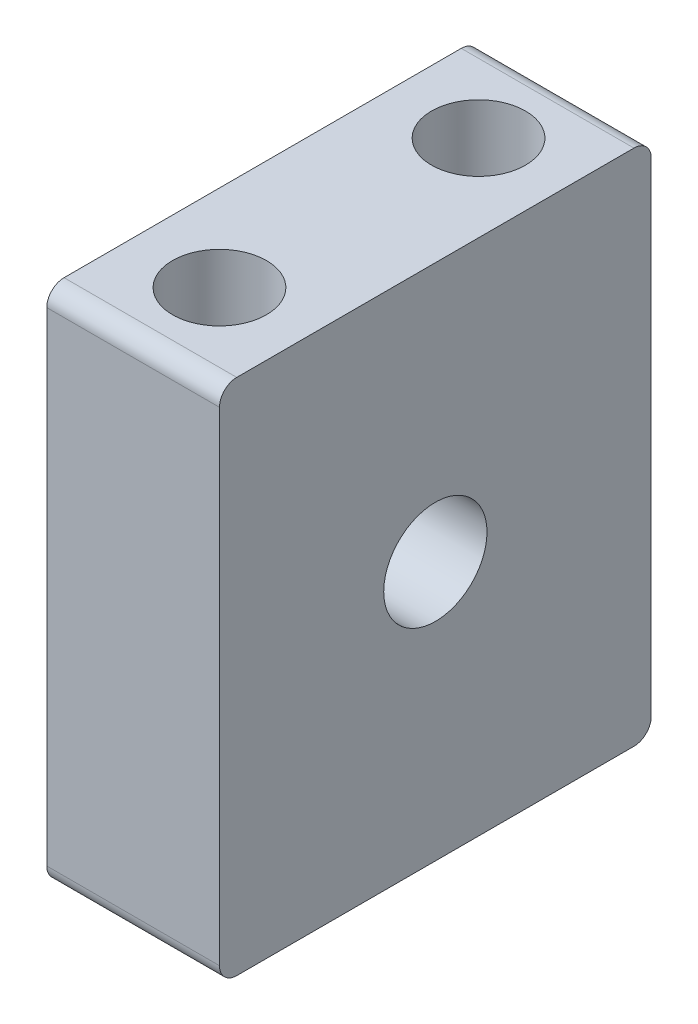
ISO-10303-21;
HEADER;
FILE_DESCRIPTION(('STEP AP214'),'2;1');
FILE_NAME('part.step','',(''),(''),'','','');
FILE_SCHEMA(('AUTOMOTIVE_DESIGN { 1 0 10303 214 1 1 1 1 }'));
ENDSEC;
DATA;
#1=APPLICATION_CONTEXT('core data for automotive mechanical design processes');
#2=APPLICATION_PROTOCOL_DEFINITION('international standard','automotive_design',2000,#1);
#3=PRODUCT_CONTEXT('',#1,'mechanical');
#4=PRODUCT('Part','Part','',(#3));
#5=PRODUCT_RELATED_PRODUCT_CATEGORY('part','',(#4));
#6=PRODUCT_DEFINITION_FORMATION('','',#4);
#7=PRODUCT_DEFINITION_CONTEXT('part definition',#1,'design');
#8=PRODUCT_DEFINITION('design','',#6,#7);
#9=PRODUCT_DEFINITION_SHAPE('','',#8);
#10=(LENGTH_UNIT() NAMED_UNIT(*) SI_UNIT(.MILLI.,.METRE.));
#11=(NAMED_UNIT(*) PLANE_ANGLE_UNIT() SI_UNIT($,.RADIAN.));
#12=(NAMED_UNIT(*) SI_UNIT($,.STERADIAN.) SOLID_ANGLE_UNIT());
#13=UNCERTAINTY_MEASURE_WITH_UNIT(LENGTH_MEASURE(1.E-05),#10,'distance_accuracy_value','');
#14=(GEOMETRIC_REPRESENTATION_CONTEXT(3) GLOBAL_UNCERTAINTY_ASSIGNED_CONTEXT((#13)) GLOBAL_UNIT_ASSIGNED_CONTEXT((#10,
#11,#12)) REPRESENTATION_CONTEXT('',''));
#15=CARTESIAN_POINT('',(0.,0.,0.));
#16=DIRECTION('',(0.,0.,1.));
#17=DIRECTION('',(1.,0.,0.));
#18=AXIS2_PLACEMENT_3D('',#15,#16,#17);
#19=CARTESIAN_POINT('',(0.,6.35000000000001,0.));
#20=DIRECTION('',(0.,-1.,0.));
#21=DIRECTION('',(0.,0.,-1.));
#22=AXIS2_PLACEMENT_3D('',#19,#20,#21);
#23=PLANE('',#22);
#24=CARTESIAN_POINT('',(-44.45,6.35000000000001,20.87372));
#25=DIRECTION('',(0.,1.,0.));
#26=DIRECTION('',(0.,0.,1.));
#27=AXIS2_PLACEMENT_3D('',#24,#25,#26);
#28=CIRCLE('',#27,1.7272);
#29=CARTESIAN_POINT('',(-44.45,6.35000000000001,22.60092));
#30=VERTEX_POINT('',#29);
#31=EDGE_CURVE('E190',#30,#30,#28,.T.);
#32=ORIENTED_EDGE('',*,*,#31,.T.);
#33=EDGE_LOOP('',(#32));
#34=FACE_BOUND('',#33,.T.);
#35=DIRECTION('',(0.,0.,1.));
#36=VECTOR('',#35,1.);
#37=CARTESIAN_POINT('',(-47.625,6.35000000000001,33.57372));
#38=LINE('',#37,#36);
#39=CARTESIAN_POINT('',(-47.625,6.35000000000001,18.33372));
#40=VERTEX_POINT('',#39);
#41=CARTESIAN_POINT('',(-47.625,6.35000000000001,32.93872));
#42=VERTEX_POINT('',#41);
#43=EDGE_CURVE('E119',#40,#42,#38,.T.);
#44=ORIENTED_EDGE('',*,*,#43,.F.);
#45=DIRECTION('',(-1.,0.,0.));
#46=VECTOR('',#45,1.);
#47=CARTESIAN_POINT('',(-41.275,6.35000000000001,18.33372));
#48=LINE('',#47,#46);
#49=CARTESIAN_POINT('',(-41.275,6.35000000000001,18.33372));
#50=VERTEX_POINT('',#49);
#51=EDGE_CURVE('E145',#40,#50,#48,.F.);
#52=ORIENTED_EDGE('',*,*,#51,.T.);
#53=DIRECTION('',(0.,0.,-1.));
#54=VECTOR('',#53,1.);
#55=CARTESIAN_POINT('',(-41.275,6.35000000000001,33.57372));
#56=LINE('',#55,#54);
#57=CARTESIAN_POINT('',(-41.275,6.35000000000001,32.93872));
#58=VERTEX_POINT('',#57);
#59=EDGE_CURVE('E170',#58,#50,#56,.T.);
#60=ORIENTED_EDGE('',*,*,#59,.F.);
#61=DIRECTION('',(1.,0.,0.));
#62=VECTOR('',#61,1.);
#63=CARTESIAN_POINT('',(-47.625,6.35000000000001,32.93872));
#64=LINE('',#63,#62);
#65=EDGE_CURVE('E50',#58,#42,#64,.F.);
#66=ORIENTED_EDGE('',*,*,#65,.T.);
#67=EDGE_LOOP('',(#44,#52,#60,#66));
#68=FACE_BOUND('',#67,.T.);
#69=CARTESIAN_POINT('',(-44.45,6.35000000000001,30.39872));
#70=DIRECTION('',(0.,1.,0.));
#71=DIRECTION('',(0.,0.,1.));
#72=AXIS2_PLACEMENT_3D('',#69,#70,#71);
#73=CIRCLE('',#72,1.7272);
#74=CARTESIAN_POINT('',(-44.45,6.35000000000001,32.12592));
#75=VERTEX_POINT('',#74);
#76=EDGE_CURVE('E167',#75,#75,#73,.T.);
#77=ORIENTED_EDGE('',*,*,#76,.T.);
#78=EDGE_LOOP('',(#77));
#79=FACE_BOUND('',#78,.T.);
#80=ADVANCED_FACE('F35',(#34,#68,#79),#23,.T.);
#81=CARTESIAN_POINT('',(-47.625,42.4978982626521,33.57372));
#82=DIRECTION('',(1.,0.,0.));
#83=DIRECTION('',(0.,0.,-1.));
#84=AXIS2_PLACEMENT_3D('',#81,#82,#83);
#85=PLANE('',#84);
#86=CARTESIAN_POINT('',(-47.625,15.875,25.63622));
#87=DIRECTION('',(-1.,0.,0.));
#88=DIRECTION('',(0.,0.,1.));
#89=AXIS2_PLACEMENT_3D('',#86,#87,#88);
#90=CIRCLE('',#89,1.89865);
#91=CARTESIAN_POINT('',(-47.625,15.875,27.53487));
#92=VERTEX_POINT('',#91);
#93=EDGE_CURVE('E196',#92,#92,#90,.T.);
#94=ORIENTED_EDGE('',*,*,#93,.F.);
#95=EDGE_LOOP('',(#94));
#96=FACE_BOUND('',#95,.T.);
#97=DIRECTION('',(0.,0.,-1.));
#98=VECTOR('',#97,1.);
#99=CARTESIAN_POINT('',(-47.625,25.4,33.57372));
#100=LINE('',#99,#98);
#101=CARTESIAN_POINT('',(-47.625,25.4,32.93872));
#102=VERTEX_POINT('',#101);
#103=CARTESIAN_POINT('',(-47.625,25.4,18.33372));
#104=VERTEX_POINT('',#103);
#105=EDGE_CURVE('E105',#102,#104,#100,.T.);
#106=ORIENTED_EDGE('',*,*,#105,.T.);
#107=CARTESIAN_POINT('',(-47.625,24.765,18.33372));
#108=DIRECTION('',(1.,0.,0.));
#109=DIRECTION('',(0.,0.,-1.));
#110=AXIS2_PLACEMENT_3D('',#107,#108,#109);
#111=CIRCLE('',#110,0.635);
#112=CARTESIAN_POINT('',(-47.625,24.765,17.69872));
#113=VERTEX_POINT('',#112);
#114=EDGE_CURVE('E100',#104,#113,#111,.F.);
#115=ORIENTED_EDGE('',*,*,#114,.T.);
#116=DIRECTION('',(0.,-1.,0.));
#117=VECTOR('',#116,1.);
#118=CARTESIAN_POINT('',(-47.625,42.4978982626521,17.69872));
#119=LINE('',#118,#117);
#120=CARTESIAN_POINT('',(-47.625,6.98500000000001,17.69872));
#121=VERTEX_POINT('',#120);
#122=EDGE_CURVE('E103',#113,#121,#119,.T.);
#123=ORIENTED_EDGE('',*,*,#122,.T.);
#124=CARTESIAN_POINT('',(-47.625,6.98500000000001,18.33372));
#125=DIRECTION('',(1.,0.,0.));
#126=DIRECTION('',(0.,0.,-1.));
#127=AXIS2_PLACEMENT_3D('',#124,#125,#126);
#128=CIRCLE('',#127,0.635);
#129=EDGE_CURVE('E57',#121,#40,#128,.F.);
#130=ORIENTED_EDGE('',*,*,#129,.T.);
#131=ORIENTED_EDGE('',*,*,#43,.T.);
#132=CARTESIAN_POINT('',(-47.625,6.98500000000001,32.93872));
#133=DIRECTION('',(1.,0.,0.));
#134=DIRECTION('',(0.,0.,-1.));
#135=AXIS2_PLACEMENT_3D('',#132,#133,#134);
#136=CIRCLE('',#135,0.635);
#137=CARTESIAN_POINT('',(-47.625,6.98500000000001,33.57372));
#138=VERTEX_POINT('',#137);
#139=EDGE_CURVE('E141',#42,#138,#136,.F.);
#140=ORIENTED_EDGE('',*,*,#139,.T.);
#141=DIRECTION('',(0.,-1.,0.));
#142=VECTOR('',#141,1.);
#143=CARTESIAN_POINT('',(-47.625,42.4978982626521,33.57372));
#144=LINE('',#143,#142);
#145=CARTESIAN_POINT('',(-47.625,24.765,33.57372));
#146=VERTEX_POINT('',#145);
#147=EDGE_CURVE('E153',#146,#138,#144,.T.);
#148=ORIENTED_EDGE('',*,*,#147,.F.);
#149=CARTESIAN_POINT('',(-47.625,24.765,32.93872));
#150=DIRECTION('',(1.,0.,0.));
#151=DIRECTION('',(0.,0.,-1.));
#152=AXIS2_PLACEMENT_3D('',#149,#150,#151);
#153=CIRCLE('',#152,0.635);
#154=EDGE_CURVE('E139',#146,#102,#153,.F.);
#155=ORIENTED_EDGE('',*,*,#154,.T.);
#156=EDGE_LOOP('',(#106,#115,#123,#130,#131,#140,#148,#155));
#157=FACE_BOUND('',#156,.T.);
#158=ADVANCED_FACE('F102',(#96,#157),#85,.F.);
#159=CARTESIAN_POINT('',(-47.625,42.4978982626521,33.57372));
#160=DIRECTION('',(0.,0.,-1.));
#161=DIRECTION('',(-1.,0.,0.));
#162=AXIS2_PLACEMENT_3D('',#159,#160,#161);
#163=PLANE('',#162);
#164=ORIENTED_EDGE('',*,*,#147,.T.);
#165=DIRECTION('',(1.,0.,0.));
#166=VECTOR('',#165,1.);
#167=CARTESIAN_POINT('',(-41.275,6.98500000000001,33.57372));
#168=LINE('',#167,#166);
#169=CARTESIAN_POINT('',(-41.275,6.98500000000001,33.57372));
#170=VERTEX_POINT('',#169);
#171=EDGE_CURVE('E11',#138,#170,#168,.T.);
#172=ORIENTED_EDGE('',*,*,#171,.T.);
#173=DIRECTION('',(0.,-1.,0.));
#174=VECTOR('',#173,1.);
#175=CARTESIAN_POINT('',(-41.275,42.4978982626521,33.57372));
#176=LINE('',#175,#174);
#177=CARTESIAN_POINT('',(-41.275,24.765,33.57372));
#178=VERTEX_POINT('',#177);
#179=EDGE_CURVE('E156',#178,#170,#176,.T.);
#180=ORIENTED_EDGE('',*,*,#179,.F.);
#181=DIRECTION('',(-1.,0.,0.));
#182=VECTOR('',#181,1.);
#183=CARTESIAN_POINT('',(-47.625,24.765,33.57372));
#184=LINE('',#183,#182);
#185=EDGE_CURVE('E43',#178,#146,#184,.T.);
#186=ORIENTED_EDGE('',*,*,#185,.T.);
#187=EDGE_LOOP('',(#164,#172,#180,#186));
#188=FACE_BOUND('',#187,.T.);
#189=ADVANCED_FACE('F152',(#188),#163,.F.);
#190=CARTESIAN_POINT('',(-41.275,42.4978982626521,33.57372));
#191=DIRECTION('',(-1.,0.,0.));
#192=DIRECTION('',(0.,0.,1.));
#193=AXIS2_PLACEMENT_3D('',#190,#191,#192);
#194=PLANE('',#193);
#195=CARTESIAN_POINT('',(-41.275,15.875,25.63622));
#196=DIRECTION('',(-1.,0.,0.));
#197=DIRECTION('',(0.,0.,1.));
#198=AXIS2_PLACEMENT_3D('',#195,#196,#197);
#199=CIRCLE('',#198,1.89865);
#200=CARTESIAN_POINT('',(-41.275,15.875,27.53487));
#201=VERTEX_POINT('',#200);
#202=EDGE_CURVE('E192',#201,#201,#199,.T.);
#203=ORIENTED_EDGE('',*,*,#202,.T.);
#204=EDGE_LOOP('',(#203));
#205=FACE_BOUND('',#204,.T.);
#206=DIRECTION('',(0.,-1.,0.));
#207=VECTOR('',#206,1.);
#208=CARTESIAN_POINT('',(-41.275,42.4978982626521,17.69872));
#209=LINE('',#208,#207);
#210=CARTESIAN_POINT('',(-41.275,24.765,17.69872));
#211=VERTEX_POINT('',#210);
#212=CARTESIAN_POINT('',(-41.275,6.98500000000001,17.69872));
#213=VERTEX_POINT('',#212);
#214=EDGE_CURVE('E171',#211,#213,#209,.T.);
#215=ORIENTED_EDGE('',*,*,#214,.F.);
#216=CARTESIAN_POINT('',(-41.275,24.765,18.33372));
#217=DIRECTION('',(-1.,0.,0.));
#218=DIRECTION('',(0.,0.,1.));
#219=AXIS2_PLACEMENT_3D('',#216,#217,#218);
#220=CIRCLE('',#219,0.635);
#221=CARTESIAN_POINT('',(-41.275,25.4,18.33372));
#222=VERTEX_POINT('',#221);
#223=EDGE_CURVE('E122',#211,#222,#220,.F.);
#224=ORIENTED_EDGE('',*,*,#223,.T.);
#225=DIRECTION('',(0.,0.,1.));
#226=VECTOR('',#225,1.);
#227=CARTESIAN_POINT('',(-41.275,25.4,33.57372));
#228=LINE('',#227,#226);
#229=CARTESIAN_POINT('',(-41.275,25.4,32.93872));
#230=VERTEX_POINT('',#229);
#231=EDGE_CURVE('E160',#222,#230,#228,.T.);
#232=ORIENTED_EDGE('',*,*,#231,.T.);
#233=CARTESIAN_POINT('',(-41.275,24.765,32.93872));
#234=DIRECTION('',(-1.,0.,0.));
#235=DIRECTION('',(0.,0.,1.));
#236=AXIS2_PLACEMENT_3D('',#233,#234,#235);
#237=CIRCLE('',#236,0.635);
#238=EDGE_CURVE('E123',#230,#178,#237,.F.);
#239=ORIENTED_EDGE('',*,*,#238,.T.);
#240=ORIENTED_EDGE('',*,*,#179,.T.);
#241=CARTESIAN_POINT('',(-41.275,6.98500000000001,32.93872));
#242=DIRECTION('',(-1.,0.,0.));
#243=DIRECTION('',(0.,0.,1.));
#244=AXIS2_PLACEMENT_3D('',#241,#242,#243);
#245=CIRCLE('',#244,0.635);
#246=EDGE_CURVE('E125',#170,#58,#245,.F.);
#247=ORIENTED_EDGE('',*,*,#246,.T.);
#248=ORIENTED_EDGE('',*,*,#59,.T.);
#249=CARTESIAN_POINT('',(-41.275,6.98500000000001,18.33372));
#250=DIRECTION('',(-1.,0.,0.));
#251=DIRECTION('',(0.,0.,1.));
#252=AXIS2_PLACEMENT_3D('',#249,#250,#251);
#253=CIRCLE('',#252,0.635);
#254=EDGE_CURVE('E132',#50,#213,#253,.F.);
#255=ORIENTED_EDGE('',*,*,#254,.T.);
#256=EDGE_LOOP('',(#215,#224,#232,#239,#240,#247,#248,#255));
#257=FACE_BOUND('',#256,.T.);
#258=ADVANCED_FACE('F212',(#205,#257),#194,.F.);
#259=CARTESIAN_POINT('',(-47.625,42.4978982626521,17.69872));
#260=DIRECTION('',(0.,0.,1.));
#261=DIRECTION('',(1.,0.,0.));
#262=AXIS2_PLACEMENT_3D('',#259,#260,#261);
#263=PLANE('',#262);
#264=ORIENTED_EDGE('',*,*,#122,.F.);
#265=DIRECTION('',(1.,0.,0.));
#266=VECTOR('',#265,1.);
#267=CARTESIAN_POINT('',(-47.625,24.765,17.69872));
#268=LINE('',#267,#266);
#269=EDGE_CURVE('E115',#113,#211,#268,.T.);
#270=ORIENTED_EDGE('',*,*,#269,.T.);
#271=ORIENTED_EDGE('',*,*,#214,.T.);
#272=DIRECTION('',(-1.,0.,0.));
#273=VECTOR('',#272,1.);
#274=CARTESIAN_POINT('',(-47.625,6.98500000000001,17.69872));
#275=LINE('',#274,#273);
#276=EDGE_CURVE('E118',#213,#121,#275,.T.);
#277=ORIENTED_EDGE('',*,*,#276,.T.);
#278=EDGE_LOOP('',(#264,#270,#271,#277));
#279=FACE_BOUND('',#278,.T.);
#280=ADVANCED_FACE('F113',(#279),#263,.F.);
#281=CARTESIAN_POINT('',(-44.45,42.4978982626521,20.87372));
#282=DIRECTION('',(0.,-1.,0.));
#283=DIRECTION('',(0.,0.,-1.));
#284=AXIS2_PLACEMENT_3D('',#281,#282,#283);
#285=CYLINDRICAL_SURFACE('',#284,1.7272);
#286=CARTESIAN_POINT('',(-44.45,25.4,20.87372));
#287=DIRECTION('',(0.,-1.,0.));
#288=DIRECTION('',(0.,0.,-1.));
#289=AXIS2_PLACEMENT_3D('',#286,#287,#288);
#290=CIRCLE('',#289,1.7272);
#291=CARTESIAN_POINT('',(-44.45,25.4,19.14652));
#292=VERTEX_POINT('',#291);
#293=EDGE_CURVE('E127',#292,#292,#290,.T.);
#294=ORIENTED_EDGE('',*,*,#293,.F.);
#295=EDGE_LOOP('',(#294));
#296=FACE_BOUND('',#295,.T.);
#297=ORIENTED_EDGE('',*,*,#31,.F.);
#298=EDGE_LOOP('',(#297));
#299=FACE_BOUND('',#298,.T.);
#300=ADVANCED_FACE('F185',(#296,#299),#285,.F.);
#301=CARTESIAN_POINT('',(-44.45,42.4978982626521,30.39872));
#302=DIRECTION('',(0.,-1.,0.));
#303=DIRECTION('',(0.,0.,-1.));
#304=AXIS2_PLACEMENT_3D('',#301,#302,#303);
#305=CYLINDRICAL_SURFACE('',#304,1.7272);
#306=CARTESIAN_POINT('',(-44.45,25.4,30.39872));
#307=DIRECTION('',(0.,-1.,0.));
#308=DIRECTION('',(0.,0.,-1.));
#309=AXIS2_PLACEMENT_3D('',#306,#307,#308);
#310=CIRCLE('',#309,1.7272);
#311=CARTESIAN_POINT('',(-44.45,25.4,28.67152));
#312=VERTEX_POINT('',#311);
#313=EDGE_CURVE('E172',#312,#312,#310,.T.);
#314=ORIENTED_EDGE('',*,*,#313,.F.);
#315=EDGE_LOOP('',(#314));
#316=FACE_BOUND('',#315,.T.);
#317=ORIENTED_EDGE('',*,*,#76,.F.);
#318=EDGE_LOOP('',(#317));
#319=FACE_BOUND('',#318,.T.);
#320=ADVANCED_FACE('F182',(#316,#319),#305,.F.);
#321=CARTESIAN_POINT('',(50.8,25.4,42.8625));
#322=DIRECTION('',(0.,-1.,0.));
#323=DIRECTION('',(0.,0.,-1.));
#324=AXIS2_PLACEMENT_3D('',#321,#322,#323);
#325=PLANE('',#324);
#326=ORIENTED_EDGE('',*,*,#313,.T.);
#327=EDGE_LOOP('',(#326));
#328=FACE_BOUND('',#327,.T.);
#329=ORIENTED_EDGE('',*,*,#293,.T.);
#330=EDGE_LOOP('',(#329));
#331=FACE_BOUND('',#330,.T.);
#332=ORIENTED_EDGE('',*,*,#231,.F.);
#333=DIRECTION('',(1.,0.,0.));
#334=VECTOR('',#333,1.);
#335=CARTESIAN_POINT('',(50.8,25.4,18.33372));
#336=LINE('',#335,#334);
#337=EDGE_CURVE('E137',#222,#104,#336,.F.);
#338=ORIENTED_EDGE('',*,*,#337,.T.);
#339=ORIENTED_EDGE('',*,*,#105,.F.);
#340=DIRECTION('',(-1.,0.,0.));
#341=VECTOR('',#340,1.);
#342=CARTESIAN_POINT('',(50.8,25.4,32.93872));
#343=LINE('',#342,#341);
#344=EDGE_CURVE('E135',#102,#230,#343,.F.);
#345=ORIENTED_EDGE('',*,*,#344,.T.);
#346=EDGE_LOOP('',(#332,#338,#339,#345));
#347=FACE_BOUND('',#346,.T.);
#348=ADVANCED_FACE('F179',(#328,#331,#347),#325,.F.);
#349=CARTESIAN_POINT('',(-41.275,15.875,25.63622));
#350=DIRECTION('',(-1.,0.,0.));
#351=DIRECTION('',(0.,0.,1.));
#352=AXIS2_PLACEMENT_3D('',#349,#350,#351);
#353=CYLINDRICAL_SURFACE('',#352,1.89865);
#354=CARTESIAN_POINT('',(-41.275,15.875,27.53487));
#355=CARTESIAN_POINT('',(-41.3411458333333,15.875,27.53487));
#356=CARTESIAN_POINT('',(-41.4072916666667,15.875,27.53487));
#357=CARTESIAN_POINT('',(-41.5395833333333,15.875,27.53487));
#358=CARTESIAN_POINT('',(-41.6057291666667,15.875,27.53487));
#359=CARTESIAN_POINT('',(-41.7380208333333,15.875,27.53487));
#360=CARTESIAN_POINT('',(-41.8041666666667,15.875,27.53487));
#361=CARTESIAN_POINT('',(-41.9364583333333,15.875,27.53487));
#362=CARTESIAN_POINT('',(-42.0026041666667,15.875,27.53487));
#363=CARTESIAN_POINT('',(-42.1348958333333,15.875,27.53487));
#364=CARTESIAN_POINT('',(-42.2010416666667,15.875,27.53487));
#365=CARTESIAN_POINT('',(-42.3333333333333,15.875,27.53487));
#366=CARTESIAN_POINT('',(-42.3994791666667,15.875,27.53487));
#367=CARTESIAN_POINT('',(-42.5317708333333,15.875,27.53487));
#368=CARTESIAN_POINT('',(-42.5979166666667,15.875,27.53487));
#369=CARTESIAN_POINT('',(-42.7302083333333,15.875,27.53487));
#370=CARTESIAN_POINT('',(-42.7963541666667,15.875,27.53487));
#371=CARTESIAN_POINT('',(-42.9286458333333,15.875,27.53487));
#372=CARTESIAN_POINT('',(-42.9947916666667,15.875,27.53487));
#373=CARTESIAN_POINT('',(-43.1270833333333,15.875,27.53487));
#374=CARTESIAN_POINT('',(-43.1932291666667,15.875,27.53487));
#375=CARTESIAN_POINT('',(-43.3255208333333,15.875,27.53487));
#376=CARTESIAN_POINT('',(-43.3916666666667,15.875,27.53487));
#377=CARTESIAN_POINT('',(-43.5239583333333,15.875,27.53487));
#378=CARTESIAN_POINT('',(-43.5901041666667,15.875,27.53487));
#379=CARTESIAN_POINT('',(-43.7223958333333,15.875,27.53487));
#380=CARTESIAN_POINT('',(-43.7885416666667,15.875,27.53487));
#381=CARTESIAN_POINT('',(-43.9208333333333,15.875,27.53487));
#382=CARTESIAN_POINT('',(-43.9869791666667,15.875,27.53487));
#383=CARTESIAN_POINT('',(-44.1192708333333,15.875,27.53487));
#384=CARTESIAN_POINT('',(-44.1854166666667,15.875,27.53487));
#385=CARTESIAN_POINT('',(-44.3177083333333,15.875,27.53487));
#386=CARTESIAN_POINT('',(-44.3838541666667,15.875,27.53487));
#387=CARTESIAN_POINT('',(-44.5161458333333,15.875,27.53487));
#388=CARTESIAN_POINT('',(-44.5822916666667,15.875,27.53487));
#389=CARTESIAN_POINT('',(-44.7145833333333,15.875,27.53487));
#390=CARTESIAN_POINT('',(-44.7807291666667,15.875,27.53487));
#391=CARTESIAN_POINT('',(-44.9130208333333,15.875,27.53487));
#392=CARTESIAN_POINT('',(-44.9791666666667,15.875,27.53487));
#393=CARTESIAN_POINT('',(-45.1114583333333,15.875,27.53487));
#394=CARTESIAN_POINT('',(-45.1776041666667,15.875,27.53487));
#395=CARTESIAN_POINT('',(-45.3098958333333,15.875,27.53487));
#396=CARTESIAN_POINT('',(-45.3760416666667,15.875,27.53487));
#397=CARTESIAN_POINT('',(-45.5083333333333,15.875,27.53487));
#398=CARTESIAN_POINT('',(-45.5744791666667,15.875,27.53487));
#399=CARTESIAN_POINT('',(-45.7067708333333,15.875,27.53487));
#400=CARTESIAN_POINT('',(-45.7729166666667,15.875,27.53487));
#401=CARTESIAN_POINT('',(-45.9052083333333,15.875,27.53487));
#402=CARTESIAN_POINT('',(-45.9713541666667,15.875,27.53487));
#403=CARTESIAN_POINT('',(-46.1036458333333,15.875,27.53487));
#404=CARTESIAN_POINT('',(-46.1697916666667,15.875,27.53487));
#405=CARTESIAN_POINT('',(-46.3020833333333,15.875,27.53487));
#406=CARTESIAN_POINT('',(-46.3682291666667,15.875,27.53487));
#407=CARTESIAN_POINT('',(-46.5005208333333,15.875,27.53487));
#408=CARTESIAN_POINT('',(-46.5666666666667,15.875,27.53487));
#409=CARTESIAN_POINT('',(-46.6989583333333,15.875,27.53487));
#410=CARTESIAN_POINT('',(-46.7651041666667,15.875,27.53487));
#411=CARTESIAN_POINT('',(-46.8973958333333,15.875,27.53487));
#412=CARTESIAN_POINT('',(-46.9635416666667,15.875,27.53487));
#413=CARTESIAN_POINT('',(-47.0958333333333,15.875,27.53487));
#414=CARTESIAN_POINT('',(-47.1619791666667,15.875,27.53487));
#415=CARTESIAN_POINT('',(-47.2942708333333,15.875,27.53487));
#416=CARTESIAN_POINT('',(-47.3604166666667,15.875,27.53487));
#417=CARTESIAN_POINT('',(-47.4927083333333,15.875,27.53487));
#418=CARTESIAN_POINT('',(-47.5588541666667,15.875,27.53487));
#419=CARTESIAN_POINT('',(-47.625,15.875,27.53487));
#420=B_SPLINE_CURVE_WITH_KNOTS('',3,(#354,#355,#356,#357,#358,#359,#360,#361,#362,#363,#364,
#365,#366,#367,#368,#369,#370,#371,#372,#373,#374,#375,#376,#377,#378,#379,#380,#381,#382,#383,
#384,#385,#386,#387,#388,#389,#390,#391,#392,#393,#394,#395,#396,#397,#398,#399,#400,#401,#402,
#403,#404,#405,#406,#407,#408,#409,#410,#411,#412,#413,#414,#415,#416,#417,#418,#419),
.UNSPECIFIED.,.F.,.F.,(4,2,2,2,2,2,2,2,2,2,2,2,2,2,2,2,2,2,2,2,2,2,2,2,2,2,2,2,2,2,2,2,4),(0.,
0.198437499999995,0.396874999999998,0.5953125,0.793749999999996,0.992187499999998,1.190625,
1.3890625,1.5875,1.7859375,1.984375,2.1828125,2.38125,2.5796875,2.778125,2.9765625,3.175,
3.3734375,3.571875,3.7703125,3.96875,4.1671875,4.365625,4.5640625,4.7625,4.96093750000001,
5.159375,5.3578125,5.55625000000001,5.7546875,5.953125,6.15156250000001,6.35),.UNSPECIFIED.);
#421=EDGE_CURVE('BSEAM204',#201,#92,#420,.T.);
#422=ORIENTED_EDGE('',*,*,#202,.F.);
#423=ORIENTED_EDGE('',*,*,#93,.T.);
#424=ORIENTED_EDGE('',*,*,#421,.T.);
#425=ORIENTED_EDGE('',*,*,#421,.F.);
#426=EDGE_LOOP('',(#422,#424,#423,#425));
#427=FACE_BOUND('',#426,.T.);
#428=ADVANCED_FACE('F204',(#427),#353,.F.);
#429=CARTESIAN_POINT('',(-47.625,24.765,18.33372));
#430=DIRECTION('',(1.,0.,0.));
#431=DIRECTION('',(0.,0.,-1.));
#432=AXIS2_PLACEMENT_3D('',#429,#430,#431);
#433=CYLINDRICAL_SURFACE('',#432,0.635);
#434=ORIENTED_EDGE('',*,*,#114,.F.);
#435=ORIENTED_EDGE('',*,*,#337,.F.);
#436=ORIENTED_EDGE('',*,*,#223,.F.);
#437=ORIENTED_EDGE('',*,*,#269,.F.);
#438=EDGE_LOOP('',(#434,#435,#436,#437));
#439=FACE_BOUND('',#438,.T.);
#440=ADVANCED_FACE('F121',(#439),#433,.T.);
#441=CARTESIAN_POINT('',(-47.625,6.98500000000001,18.33372));
#442=DIRECTION('',(1.,0.,0.));
#443=DIRECTION('',(0.,0.,-1.));
#444=AXIS2_PLACEMENT_3D('',#441,#442,#443);
#445=CYLINDRICAL_SURFACE('',#444,0.635);
#446=ORIENTED_EDGE('',*,*,#254,.F.);
#447=ORIENTED_EDGE('',*,*,#51,.F.);
#448=ORIENTED_EDGE('',*,*,#129,.F.);
#449=ORIENTED_EDGE('',*,*,#276,.F.);
#450=EDGE_LOOP('',(#446,#447,#448,#449));
#451=FACE_BOUND('',#450,.T.);
#452=ADVANCED_FACE('F221',(#451),#445,.T.);
#453=CARTESIAN_POINT('',(-47.625,6.98500000000001,32.93872));
#454=DIRECTION('',(-1.,0.,0.));
#455=DIRECTION('',(0.,0.,1.));
#456=AXIS2_PLACEMENT_3D('',#453,#454,#455);
#457=CYLINDRICAL_SURFACE('',#456,0.635);
#458=ORIENTED_EDGE('',*,*,#139,.F.);
#459=ORIENTED_EDGE('',*,*,#65,.F.);
#460=ORIENTED_EDGE('',*,*,#246,.F.);
#461=ORIENTED_EDGE('',*,*,#171,.F.);
#462=EDGE_LOOP('',(#458,#459,#460,#461));
#463=FACE_BOUND('',#462,.T.);
#464=ADVANCED_FACE('F223',(#463),#457,.T.);
#465=CARTESIAN_POINT('',(-47.625,24.765,32.93872));
#466=DIRECTION('',(-1.,0.,0.));
#467=DIRECTION('',(0.,0.,1.));
#468=AXIS2_PLACEMENT_3D('',#465,#466,#467);
#469=CYLINDRICAL_SURFACE('',#468,0.635);
#470=ORIENTED_EDGE('',*,*,#238,.F.);
#471=ORIENTED_EDGE('',*,*,#344,.F.);
#472=ORIENTED_EDGE('',*,*,#154,.F.);
#473=ORIENTED_EDGE('',*,*,#185,.F.);
#474=EDGE_LOOP('',(#470,#471,#472,#473));
#475=FACE_BOUND('',#474,.T.);
#476=ADVANCED_FACE('F37',(#475),#469,.T.);
#477=CLOSED_SHELL('',(#80,#158,#189,#258,#280,#300,#320,#348,#428,#440,#452,#464,#476));
#478=MANIFOLD_SOLID_BREP('B2',#477);
#479=ADVANCED_BREP_SHAPE_REPRESENTATION('',(#18,#478),#14);
#480=SHAPE_DEFINITION_REPRESENTATION(#9,#479);
ENDSEC;
END-ISO-10303-21;
